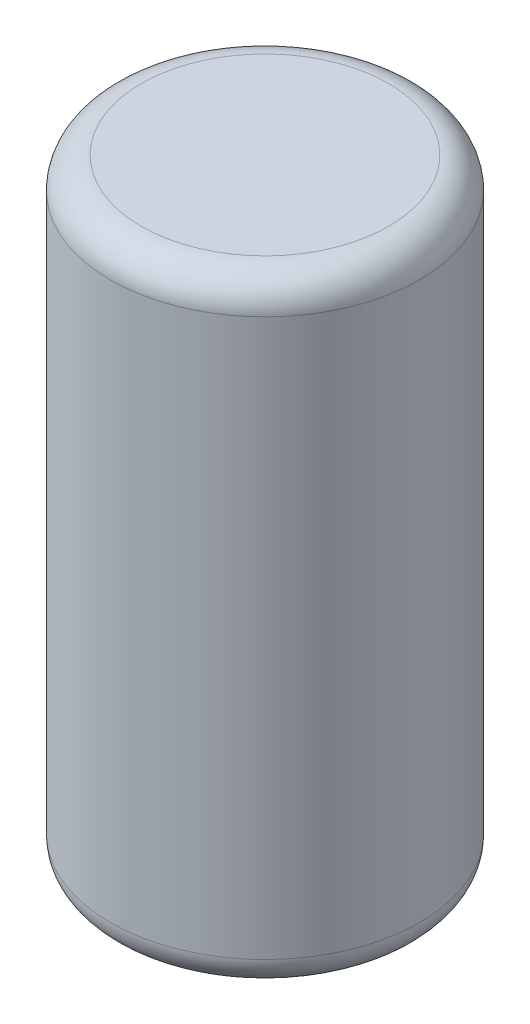
ISO-10303-21;
HEADER;
FILE_DESCRIPTION(('STEP AP214'),'2;1');
FILE_NAME('part.step','',(''),(''),'','','');
FILE_SCHEMA(('AUTOMOTIVE_DESIGN { 1 0 10303 214 1 1 1 1 }'));
ENDSEC;
DATA;
#1=APPLICATION_CONTEXT('core data for automotive mechanical design processes');
#2=APPLICATION_PROTOCOL_DEFINITION('international standard','automotive_design',2000,#1);
#3=PRODUCT_CONTEXT('',#1,'mechanical');
#4=PRODUCT('Part','Part','',(#3));
#5=PRODUCT_RELATED_PRODUCT_CATEGORY('part','',(#4));
#6=PRODUCT_DEFINITION_FORMATION('','',#4);
#7=PRODUCT_DEFINITION_CONTEXT('part definition',#1,'design');
#8=PRODUCT_DEFINITION('design','',#6,#7);
#9=PRODUCT_DEFINITION_SHAPE('','',#8);
#10=(LENGTH_UNIT() NAMED_UNIT(*) SI_UNIT(.MILLI.,.METRE.));
#11=(NAMED_UNIT(*) PLANE_ANGLE_UNIT() SI_UNIT($,.RADIAN.));
#12=(NAMED_UNIT(*) SI_UNIT($,.STERADIAN.) SOLID_ANGLE_UNIT());
#13=UNCERTAINTY_MEASURE_WITH_UNIT(LENGTH_MEASURE(1.E-05),#10,'distance_accuracy_value','');
#14=(GEOMETRIC_REPRESENTATION_CONTEXT(3) GLOBAL_UNCERTAINTY_ASSIGNED_CONTEXT((#13)) GLOBAL_UNIT_ASSIGNED_CONTEXT((#10,
#11,#12)) REPRESENTATION_CONTEXT('',''));
#15=CARTESIAN_POINT('',(0.,0.,0.));
#16=DIRECTION('',(0.,0.,1.));
#17=DIRECTION('',(1.,0.,0.));
#18=AXIS2_PLACEMENT_3D('',#15,#16,#17);
#19=CARTESIAN_POINT('',(0.,12.7,0.));
#20=DIRECTION('',(0.,-1.,0.));
#21=DIRECTION('',(0.,0.,-1.));
#22=AXIS2_PLACEMENT_3D('',#19,#20,#21);
#23=CYLINDRICAL_SURFACE('',#22,3.175);
#24=CARTESIAN_POINT('',(0.,0.635,0.));
#25=DIRECTION('',(0.,1.,0.));
#26=DIRECTION('',(0.,0.,1.));
#27=AXIS2_PLACEMENT_3D('',#24,#25,#26);
#28=CIRCLE('',#27,3.175);
#29=CARTESIAN_POINT('',(0.,0.635,3.175));
#30=VERTEX_POINT('',#29);
#31=EDGE_CURVE('E43',#30,#30,#28,.T.);
#32=ORIENTED_EDGE('',*,*,#31,.T.);
#33=EDGE_LOOP('',(#32));
#34=FACE_BOUND('',#33,.T.);
#35=CARTESIAN_POINT('',(0.,12.065,0.));
#36=DIRECTION('',(0.,1.,0.));
#37=DIRECTION('',(0.,0.,1.));
#38=AXIS2_PLACEMENT_3D('',#35,#36,#37);
#39=CIRCLE('',#38,3.175);
#40=CARTESIAN_POINT('',(0.,12.065,3.175));
#41=VERTEX_POINT('',#40);
#42=EDGE_CURVE('E47',#41,#41,#39,.F.);
#43=ORIENTED_EDGE('',*,*,#42,.T.);
#44=EDGE_LOOP('',(#43));
#45=FACE_BOUND('',#44,.T.);
#46=ADVANCED_FACE('F32',(#34,#45),#23,.T.);
#47=CARTESIAN_POINT('',(0.,12.7,0.));
#48=DIRECTION('',(0.,1.,0.));
#49=DIRECTION('',(0.,0.,1.));
#50=AXIS2_PLACEMENT_3D('',#47,#48,#49);
#51=PLANE('',#50);
#52=CARTESIAN_POINT('',(0.,12.7,0.));
#53=DIRECTION('',(0.,1.,0.));
#54=DIRECTION('',(0.,0.,1.));
#55=AXIS2_PLACEMENT_3D('',#52,#53,#54);
#56=CIRCLE('',#55,2.54);
#57=CARTESIAN_POINT('',(0.,12.7,2.54));
#58=VERTEX_POINT('',#57);
#59=EDGE_CURVE('E10',#58,#58,#56,.T.);
#60=ORIENTED_EDGE('',*,*,#59,.T.);
#61=EDGE_LOOP('',(#60));
#62=FACE_BOUND('',#61,.T.);
#63=ADVANCED_FACE('F63',(#62),#51,.T.);
#64=CARTESIAN_POINT('',(0.,0.,0.));
#65=DIRECTION('',(0.,1.,0.));
#66=DIRECTION('',(0.,0.,1.));
#67=AXIS2_PLACEMENT_3D('',#64,#65,#66);
#68=PLANE('',#67);
#69=CARTESIAN_POINT('',(0.,0.,0.));
#70=DIRECTION('',(0.,1.,0.));
#71=DIRECTION('',(0.,0.,1.));
#72=AXIS2_PLACEMENT_3D('',#69,#70,#71);
#73=CIRCLE('',#72,2.54);
#74=CARTESIAN_POINT('',(0.,0.,2.54));
#75=VERTEX_POINT('',#74);
#76=EDGE_CURVE('E39',#75,#75,#73,.F.);
#77=ORIENTED_EDGE('',*,*,#76,.T.);
#78=EDGE_LOOP('',(#77));
#79=FACE_BOUND('',#78,.T.);
#80=ADVANCED_FACE('F60',(#79),#68,.F.);
#81=CARTESIAN_POINT('',(0.,0.635,0.));
#82=DIRECTION('',(0.,1.,0.));
#83=DIRECTION('',(0.,0.,1.));
#84=AXIS2_PLACEMENT_3D('',#81,#82,#83);
#85=TOROIDAL_SURFACE('',#84,2.54,0.635);
#86=ORIENTED_EDGE('',*,*,#76,.F.);
#87=EDGE_LOOP('',(#86));
#88=FACE_BOUND('',#87,.T.);
#89=ORIENTED_EDGE('',*,*,#31,.F.);
#90=EDGE_LOOP('',(#89));
#91=FACE_BOUND('',#90,.T.);
#92=ADVANCED_FACE('F56',(#88,#91),#85,.T.);
#93=CARTESIAN_POINT('',(0.,12.065,0.));
#94=DIRECTION('',(0.,1.,0.));
#95=DIRECTION('',(0.,0.,1.));
#96=AXIS2_PLACEMENT_3D('',#93,#94,#95);
#97=TOROIDAL_SURFACE('',#96,2.54,0.635);
#98=ORIENTED_EDGE('',*,*,#42,.F.);
#99=EDGE_LOOP('',(#98));
#100=FACE_BOUND('',#99,.T.);
#101=ORIENTED_EDGE('',*,*,#59,.F.);
#102=EDGE_LOOP('',(#101));
#103=FACE_BOUND('',#102,.T.);
#104=ADVANCED_FACE('F34',(#100,#103),#97,.T.);
#105=CLOSED_SHELL('',(#46,#63,#80,#92,#104));
#106=MANIFOLD_SOLID_BREP('B2',#105);
#107=ADVANCED_BREP_SHAPE_REPRESENTATION('',(#18,#106),#14);
#108=SHAPE_DEFINITION_REPRESENTATION(#9,#107);
ENDSEC;
END-ISO-10303-21;
